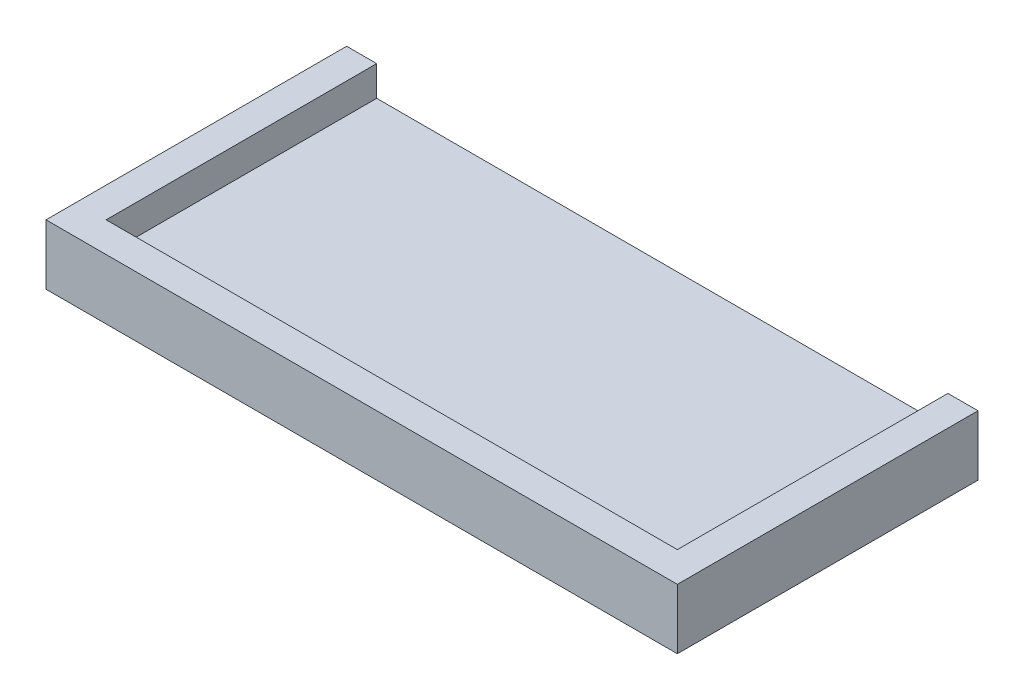
ISO-10303-21;
HEADER;
FILE_DESCRIPTION(('STEP AP214'),'2;1');
FILE_NAME('part.step','',(''),(''),'','','');
FILE_SCHEMA(('AUTOMOTIVE_DESIGN { 1 0 10303 214 1 1 1 1 }'));
ENDSEC;
DATA;
#1=APPLICATION_CONTEXT('core data for automotive mechanical design processes');
#2=APPLICATION_PROTOCOL_DEFINITION('international standard','automotive_design',2000,#1);
#3=PRODUCT_CONTEXT('',#1,'mechanical');
#4=PRODUCT('Part','Part','',(#3));
#5=PRODUCT_RELATED_PRODUCT_CATEGORY('part','',(#4));
#6=PRODUCT_DEFINITION_FORMATION('','',#4);
#7=PRODUCT_DEFINITION_CONTEXT('part definition',#1,'design');
#8=PRODUCT_DEFINITION('design','',#6,#7);
#9=PRODUCT_DEFINITION_SHAPE('','',#8);
#10=(LENGTH_UNIT() NAMED_UNIT(*) SI_UNIT(.MILLI.,.METRE.));
#11=(NAMED_UNIT(*) PLANE_ANGLE_UNIT() SI_UNIT($,.RADIAN.));
#12=(NAMED_UNIT(*) SI_UNIT($,.STERADIAN.) SOLID_ANGLE_UNIT());
#13=UNCERTAINTY_MEASURE_WITH_UNIT(LENGTH_MEASURE(1.E-05),#10,'distance_accuracy_value','');
#14=(GEOMETRIC_REPRESENTATION_CONTEXT(3) GLOBAL_UNCERTAINTY_ASSIGNED_CONTEXT((#13)) GLOBAL_UNIT_ASSIGNED_CONTEXT((#10,
#11,#12)) REPRESENTATION_CONTEXT('',''));
#15=CARTESIAN_POINT('',(0.,0.,0.));
#16=DIRECTION('',(0.,0.,1.));
#17=DIRECTION('',(1.,0.,0.));
#18=AXIS2_PLACEMENT_3D('',#15,#16,#17);
#19=CARTESIAN_POINT('',(0.,5.,0.));
#20=DIRECTION('',(0.,-1.,0.));
#21=DIRECTION('',(0.,0.,-1.));
#22=AXIS2_PLACEMENT_3D('',#19,#20,#21);
#23=PLANE('',#22);
#24=DIRECTION('',(0.,0.,-1.));
#25=VECTOR('',#24,1.);
#26=CARTESIAN_POINT('',(-47.5,5.,20.));
#27=LINE('',#26,#25);
#28=CARTESIAN_POINT('',(-47.5,5.,20.));
#29=VERTEX_POINT('',#28);
#30=CARTESIAN_POINT('',(-47.5,5.,-25.));
#31=VERTEX_POINT('',#30);
#32=EDGE_CURVE('E59',#29,#31,#27,.T.);
#33=ORIENTED_EDGE('',*,*,#32,.F.);
#34=DIRECTION('',(-1.,0.,0.));
#35=VECTOR('',#34,1.);
#36=CARTESIAN_POINT('',(47.5,5.,20.));
#37=LINE('',#36,#35);
#38=CARTESIAN_POINT('',(47.5,5.,20.));
#39=VERTEX_POINT('',#38);
#40=EDGE_CURVE('E134',#39,#29,#37,.T.);
#41=ORIENTED_EDGE('',*,*,#40,.F.);
#42=DIRECTION('',(0.,0.,1.));
#43=VECTOR('',#42,1.);
#44=CARTESIAN_POINT('',(47.5,5.,-25.));
#45=LINE('',#44,#43);
#46=CARTESIAN_POINT('',(47.5,5.,-25.));
#47=VERTEX_POINT('',#46);
#48=EDGE_CURVE('E155',#47,#39,#45,.T.);
#49=ORIENTED_EDGE('',*,*,#48,.F.);
#50=DIRECTION('',(-1.,0.,0.));
#51=VECTOR('',#50,1.);
#52=CARTESIAN_POINT('',(-52.5,5.,-25.));
#53=LINE('',#52,#51);
#54=EDGE_CURVE('E64',#47,#31,#53,.T.);
#55=ORIENTED_EDGE('',*,*,#54,.T.);
#56=EDGE_LOOP('',(#33,#41,#49,#55));
#57=FACE_BOUND('',#56,.T.);
#58=ADVANCED_FACE('F43',(#57),#23,.F.);
#59=CARTESIAN_POINT('',(52.5,5.,25.));
#60=DIRECTION('',(-1.,0.,0.));
#61=DIRECTION('',(0.,0.,1.));
#62=AXIS2_PLACEMENT_3D('',#59,#60,#61);
#63=PLANE('',#62);
#64=DIRECTION('',(0.,0.,-1.));
#65=VECTOR('',#64,1.);
#66=CARTESIAN_POINT('',(52.5,0.,25.));
#67=LINE('',#66,#65);
#68=CARTESIAN_POINT('',(52.5,0.,25.));
#69=VERTEX_POINT('',#68);
#70=CARTESIAN_POINT('',(52.5,0.,-25.));
#71=VERTEX_POINT('',#70);
#72=EDGE_CURVE('E175',#69,#71,#67,.T.);
#73=ORIENTED_EDGE('',*,*,#72,.T.);
#74=DIRECTION('',(0.,-1.,0.));
#75=VECTOR('',#74,1.);
#76=CARTESIAN_POINT('',(52.5,5.,-25.));
#77=LINE('',#76,#75);
#78=CARTESIAN_POINT('',(52.5,10.,-25.));
#79=VERTEX_POINT('',#78);
#80=EDGE_CURVE('E11',#79,#71,#77,.T.);
#81=ORIENTED_EDGE('',*,*,#80,.F.);
#82=DIRECTION('',(0.,0.,-1.));
#83=VECTOR('',#82,1.);
#84=CARTESIAN_POINT('',(52.5,10.,25.));
#85=LINE('',#84,#83);
#86=CARTESIAN_POINT('',(52.5,10.,25.));
#87=VERTEX_POINT('',#86);
#88=EDGE_CURVE('E139',#87,#79,#85,.T.);
#89=ORIENTED_EDGE('',*,*,#88,.F.);
#90=DIRECTION('',(0.,-1.,0.));
#91=VECTOR('',#90,1.);
#92=CARTESIAN_POINT('',(52.5,5.,25.));
#93=LINE('',#92,#91);
#94=EDGE_CURVE('E178',#87,#69,#93,.T.);
#95=ORIENTED_EDGE('',*,*,#94,.T.);
#96=EDGE_LOOP('',(#73,#81,#89,#95));
#97=FACE_BOUND('',#96,.T.);
#98=ADVANCED_FACE('F45',(#97),#63,.F.);
#99=CARTESIAN_POINT('',(-52.5,5.,-25.));
#100=DIRECTION('',(0.,0.,1.));
#101=DIRECTION('',(1.,0.,0.));
#102=AXIS2_PLACEMENT_3D('',#99,#100,#101);
#103=PLANE('',#102);
#104=DIRECTION('',(-1.,0.,0.));
#105=VECTOR('',#104,1.);
#106=CARTESIAN_POINT('',(-52.5,0.,-25.));
#107=LINE('',#106,#105);
#108=CARTESIAN_POINT('',(-52.5,0.,-25.));
#109=VERTEX_POINT('',#108);
#110=EDGE_CURVE('E112',#71,#109,#107,.T.);
#111=ORIENTED_EDGE('',*,*,#110,.T.);
#112=DIRECTION('',(0.,-1.,0.));
#113=VECTOR('',#112,1.);
#114=CARTESIAN_POINT('',(-52.5,5.,-25.));
#115=LINE('',#114,#113);
#116=CARTESIAN_POINT('',(-52.5,10.,-25.));
#117=VERTEX_POINT('',#116);
#118=EDGE_CURVE('E52',#117,#109,#115,.T.);
#119=ORIENTED_EDGE('',*,*,#118,.F.);
#120=DIRECTION('',(-1.,0.,0.));
#121=VECTOR('',#120,1.);
#122=CARTESIAN_POINT('',(-47.5,10.,-25.));
#123=LINE('',#122,#121);
#124=CARTESIAN_POINT('',(-47.5,10.,-25.));
#125=VERTEX_POINT('',#124);
#126=EDGE_CURVE('E111',#125,#117,#123,.T.);
#127=ORIENTED_EDGE('',*,*,#126,.F.);
#128=DIRECTION('',(0.,-1.,0.));
#129=VECTOR('',#128,1.);
#130=CARTESIAN_POINT('',(-47.5,10.,-25.));
#131=LINE('',#130,#129);
#132=EDGE_CURVE('E154',#125,#31,#131,.T.);
#133=ORIENTED_EDGE('',*,*,#132,.T.);
#134=ORIENTED_EDGE('',*,*,#54,.F.);
#135=DIRECTION('',(0.,-1.,0.));
#136=VECTOR('',#135,1.);
#137=CARTESIAN_POINT('',(47.5,10.,-25.));
#138=LINE('',#137,#136);
#139=CARTESIAN_POINT('',(47.5,10.,-25.));
#140=VERTEX_POINT('',#139);
#141=EDGE_CURVE('E171',#140,#47,#138,.T.);
#142=ORIENTED_EDGE('',*,*,#141,.F.);
#143=DIRECTION('',(-1.,0.,0.));
#144=VECTOR('',#143,1.);
#145=CARTESIAN_POINT('',(52.5,10.,-25.));
#146=LINE('',#145,#144);
#147=EDGE_CURVE('E143',#79,#140,#146,.T.);
#148=ORIENTED_EDGE('',*,*,#147,.F.);
#149=ORIENTED_EDGE('',*,*,#80,.T.);
#150=EDGE_LOOP('',(#111,#119,#127,#133,#134,#142,#148,#149));
#151=FACE_BOUND('',#150,.T.);
#152=ADVANCED_FACE('F108',(#151),#103,.F.);
#153=CARTESIAN_POINT('',(-52.5,5.,25.));
#154=DIRECTION('',(1.,0.,0.));
#155=DIRECTION('',(0.,0.,-1.));
#156=AXIS2_PLACEMENT_3D('',#153,#154,#155);
#157=PLANE('',#156);
#158=DIRECTION('',(0.,0.,1.));
#159=VECTOR('',#158,1.);
#160=CARTESIAN_POINT('',(-52.5,0.,25.));
#161=LINE('',#160,#159);
#162=CARTESIAN_POINT('',(-52.5,0.,25.));
#163=VERTEX_POINT('',#162);
#164=EDGE_CURVE('E185',#109,#163,#161,.T.);
#165=ORIENTED_EDGE('',*,*,#164,.T.);
#166=DIRECTION('',(0.,-1.,0.));
#167=VECTOR('',#166,1.);
#168=CARTESIAN_POINT('',(-52.5,5.,25.));
#169=LINE('',#168,#167);
#170=CARTESIAN_POINT('',(-52.5,10.,25.));
#171=VERTEX_POINT('',#170);
#172=EDGE_CURVE('E116',#171,#163,#169,.T.);
#173=ORIENTED_EDGE('',*,*,#172,.F.);
#174=DIRECTION('',(0.,0.,1.));
#175=VECTOR('',#174,1.);
#176=CARTESIAN_POINT('',(-52.5,10.,-25.));
#177=LINE('',#176,#175);
#178=EDGE_CURVE('E118',#117,#171,#177,.T.);
#179=ORIENTED_EDGE('',*,*,#178,.F.);
#180=ORIENTED_EDGE('',*,*,#118,.T.);
#181=EDGE_LOOP('',(#165,#173,#179,#180));
#182=FACE_BOUND('',#181,.T.);
#183=ADVANCED_FACE('F119',(#182),#157,.F.);
#184=CARTESIAN_POINT('',(-52.5,5.,25.));
#185=DIRECTION('',(0.,0.,-1.));
#186=DIRECTION('',(-1.,0.,0.));
#187=AXIS2_PLACEMENT_3D('',#184,#185,#186);
#188=PLANE('',#187);
#189=DIRECTION('',(1.,0.,0.));
#190=VECTOR('',#189,1.);
#191=CARTESIAN_POINT('',(-52.5,0.,25.));
#192=LINE('',#191,#190);
#193=EDGE_CURVE('E179',#163,#69,#192,.T.);
#194=ORIENTED_EDGE('',*,*,#193,.T.);
#195=ORIENTED_EDGE('',*,*,#94,.F.);
#196=DIRECTION('',(1.,0.,0.));
#197=VECTOR('',#196,1.);
#198=CARTESIAN_POINT('',(-52.5,10.,25.));
#199=LINE('',#198,#197);
#200=EDGE_CURVE('E125',#171,#87,#199,.T.);
#201=ORIENTED_EDGE('',*,*,#200,.F.);
#202=ORIENTED_EDGE('',*,*,#172,.T.);
#203=EDGE_LOOP('',(#194,#195,#201,#202));
#204=FACE_BOUND('',#203,.T.);
#205=ADVANCED_FACE('F196',(#204),#188,.F.);
#206=CARTESIAN_POINT('',(0.,0.,0.));
#207=DIRECTION('',(0.,-1.,0.));
#208=DIRECTION('',(0.,0.,-1.));
#209=AXIS2_PLACEMENT_3D('',#206,#207,#208);
#210=PLANE('',#209);
#211=ORIENTED_EDGE('',*,*,#72,.F.);
#212=ORIENTED_EDGE('',*,*,#193,.F.);
#213=ORIENTED_EDGE('',*,*,#164,.F.);
#214=ORIENTED_EDGE('',*,*,#110,.F.);
#215=EDGE_LOOP('',(#211,#212,#213,#214));
#216=FACE_BOUND('',#215,.T.);
#217=ADVANCED_FACE('F199',(#216),#210,.T.);
#218=CARTESIAN_POINT('',(47.5,10.,-25.));
#219=DIRECTION('',(1.,0.,0.));
#220=DIRECTION('',(0.,0.,-1.));
#221=AXIS2_PLACEMENT_3D('',#218,#219,#220);
#222=PLANE('',#221);
#223=ORIENTED_EDGE('',*,*,#48,.T.);
#224=DIRECTION('',(0.,-1.,0.));
#225=VECTOR('',#224,1.);
#226=CARTESIAN_POINT('',(47.5,10.,20.));
#227=LINE('',#226,#225);
#228=CARTESIAN_POINT('',(47.5,10.,20.));
#229=VERTEX_POINT('',#228);
#230=EDGE_CURVE('E167',#229,#39,#227,.T.);
#231=ORIENTED_EDGE('',*,*,#230,.F.);
#232=DIRECTION('',(0.,0.,1.));
#233=VECTOR('',#232,1.);
#234=CARTESIAN_POINT('',(47.5,10.,-25.));
#235=LINE('',#234,#233);
#236=EDGE_CURVE('E146',#140,#229,#235,.T.);
#237=ORIENTED_EDGE('',*,*,#236,.F.);
#238=ORIENTED_EDGE('',*,*,#141,.T.);
#239=EDGE_LOOP('',(#223,#231,#237,#238));
#240=FACE_BOUND('',#239,.T.);
#241=ADVANCED_FACE('F207',(#240),#222,.F.);
#242=CARTESIAN_POINT('',(47.5,10.,20.));
#243=DIRECTION('',(0.,0.,1.));
#244=DIRECTION('',(1.,0.,0.));
#245=AXIS2_PLACEMENT_3D('',#242,#243,#244);
#246=PLANE('',#245);
#247=ORIENTED_EDGE('',*,*,#40,.T.);
#248=DIRECTION('',(0.,-1.,0.));
#249=VECTOR('',#248,1.);
#250=CARTESIAN_POINT('',(-47.5,10.,20.));
#251=LINE('',#250,#249);
#252=CARTESIAN_POINT('',(-47.5,10.,20.));
#253=VERTEX_POINT('',#252);
#254=EDGE_CURVE('E163',#253,#29,#251,.T.);
#255=ORIENTED_EDGE('',*,*,#254,.F.);
#256=DIRECTION('',(-1.,0.,0.));
#257=VECTOR('',#256,1.);
#258=CARTESIAN_POINT('',(47.5,10.,20.));
#259=LINE('',#258,#257);
#260=EDGE_CURVE('E149',#229,#253,#259,.T.);
#261=ORIENTED_EDGE('',*,*,#260,.F.);
#262=ORIENTED_EDGE('',*,*,#230,.T.);
#263=EDGE_LOOP('',(#247,#255,#261,#262));
#264=FACE_BOUND('',#263,.T.);
#265=ADVANCED_FACE('F211',(#264),#246,.F.);
#266=CARTESIAN_POINT('',(-47.5,10.,20.));
#267=DIRECTION('',(-1.,0.,0.));
#268=DIRECTION('',(0.,0.,1.));
#269=AXIS2_PLACEMENT_3D('',#266,#267,#268);
#270=PLANE('',#269);
#271=ORIENTED_EDGE('',*,*,#32,.T.);
#272=ORIENTED_EDGE('',*,*,#132,.F.);
#273=DIRECTION('',(0.,0.,-1.));
#274=VECTOR('',#273,1.);
#275=CARTESIAN_POINT('',(-47.5,10.,20.));
#276=LINE('',#275,#274);
#277=EDGE_CURVE('E129',#253,#125,#276,.T.);
#278=ORIENTED_EDGE('',*,*,#277,.F.);
#279=ORIENTED_EDGE('',*,*,#254,.T.);
#280=EDGE_LOOP('',(#271,#272,#278,#279));
#281=FACE_BOUND('',#280,.T.);
#282=ADVANCED_FACE('F213',(#281),#270,.F.);
#283=CARTESIAN_POINT('',(0.,10.,0.));
#284=DIRECTION('',(0.,1.,0.));
#285=DIRECTION('',(0.,0.,1.));
#286=AXIS2_PLACEMENT_3D('',#283,#284,#285);
#287=PLANE('',#286);
#288=ORIENTED_EDGE('',*,*,#126,.T.);
#289=ORIENTED_EDGE('',*,*,#178,.T.);
#290=ORIENTED_EDGE('',*,*,#200,.T.);
#291=ORIENTED_EDGE('',*,*,#88,.T.);
#292=ORIENTED_EDGE('',*,*,#147,.T.);
#293=ORIENTED_EDGE('',*,*,#236,.T.);
#294=ORIENTED_EDGE('',*,*,#260,.T.);
#295=ORIENTED_EDGE('',*,*,#277,.T.);
#296=EDGE_LOOP('',(#288,#289,#290,#291,#292,#293,#294,#295));
#297=FACE_BOUND('',#296,.T.);
#298=ADVANCED_FACE('F127',(#297),#287,.T.);
#299=CLOSED_SHELL('',(#58,#98,#152,#183,#205,#217,#241,#265,#282,#298));
#300=MANIFOLD_SOLID_BREP('B2',#299);
#301=ADVANCED_BREP_SHAPE_REPRESENTATION('',(#18,#300),#14);
#302=SHAPE_DEFINITION_REPRESENTATION(#9,#301);
ENDSEC;
END-ISO-10303-21;
